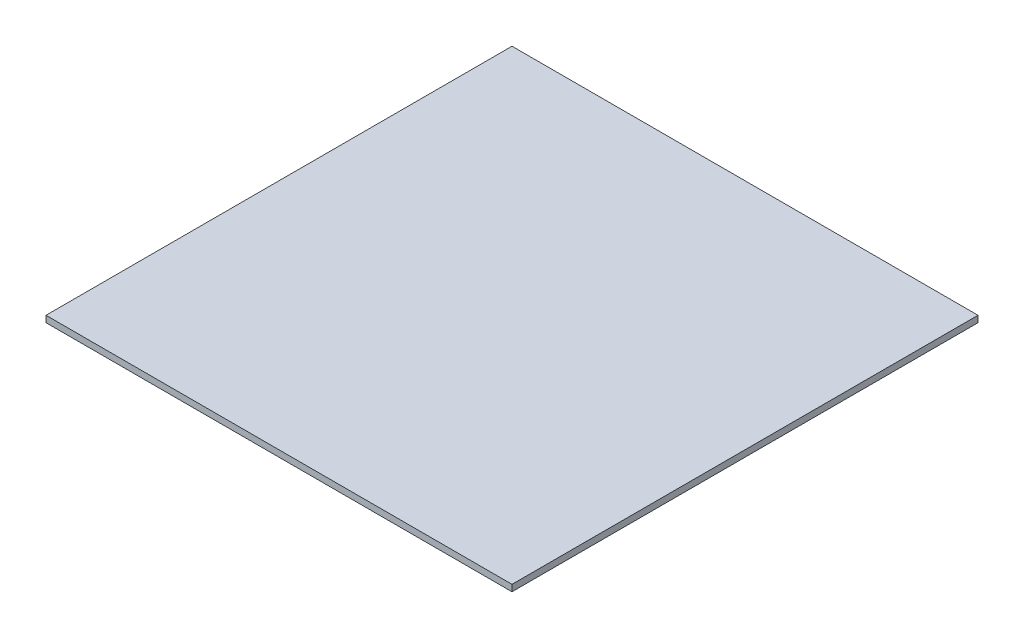
ISO-10303-21;
HEADER;
FILE_DESCRIPTION(('STEP AP214'),'2;1');
FILE_NAME('part.step','',(''),(''),'','','');
FILE_SCHEMA(('AUTOMOTIVE_DESIGN { 1 0 10303 214 1 1 1 1 }'));
ENDSEC;
DATA;
#1=APPLICATION_CONTEXT('core data for automotive mechanical design processes');
#2=APPLICATION_PROTOCOL_DEFINITION('international standard','automotive_design',2000,#1);
#3=PRODUCT_CONTEXT('',#1,'mechanical');
#4=PRODUCT('Part','Part','',(#3));
#5=PRODUCT_RELATED_PRODUCT_CATEGORY('part','',(#4));
#6=PRODUCT_DEFINITION_FORMATION('','',#4);
#7=PRODUCT_DEFINITION_CONTEXT('part definition',#1,'design');
#8=PRODUCT_DEFINITION('design','',#6,#7);
#9=PRODUCT_DEFINITION_SHAPE('','',#8);
#10=(LENGTH_UNIT() NAMED_UNIT(*) SI_UNIT(.MILLI.,.METRE.));
#11=(NAMED_UNIT(*) PLANE_ANGLE_UNIT() SI_UNIT($,.RADIAN.));
#12=(NAMED_UNIT(*) SI_UNIT($,.STERADIAN.) SOLID_ANGLE_UNIT());
#13=UNCERTAINTY_MEASURE_WITH_UNIT(LENGTH_MEASURE(1.E-05),#10,'distance_accuracy_value','');
#14=(GEOMETRIC_REPRESENTATION_CONTEXT(3) GLOBAL_UNCERTAINTY_ASSIGNED_CONTEXT((#13)) GLOBAL_UNIT_ASSIGNED_CONTEXT((#10,
#11,#12)) REPRESENTATION_CONTEXT('',''));
#15=CARTESIAN_POINT('',(0.,0.,0.));
#16=DIRECTION('',(0.,0.,1.));
#17=DIRECTION('',(1.,0.,0.));
#18=AXIS2_PLACEMENT_3D('',#15,#16,#17);
#19=CARTESIAN_POINT('',(228.6,6.35,-228.6));
#20=DIRECTION('',(-1.,0.,0.));
#21=DIRECTION('',(0.,0.,1.));
#22=AXIS2_PLACEMENT_3D('',#19,#20,#21);
#23=PLANE('',#22);
#24=DIRECTION('',(0.,0.,-1.));
#25=VECTOR('',#24,1.);
#26=CARTESIAN_POINT('',(228.6,0.,-228.6));
#27=LINE('',#26,#25);
#28=CARTESIAN_POINT('',(228.6,0.,228.6));
#29=VERTEX_POINT('',#28);
#30=CARTESIAN_POINT('',(228.6,0.,-228.6));
#31=VERTEX_POINT('',#30);
#32=EDGE_CURVE('E97',#29,#31,#27,.T.);
#33=ORIENTED_EDGE('',*,*,#32,.T.);
#34=DIRECTION('',(0.,-1.,0.));
#35=VECTOR('',#34,1.);
#36=CARTESIAN_POINT('',(228.6,6.35,-228.6));
#37=LINE('',#36,#35);
#38=CARTESIAN_POINT('',(228.6,6.35,-228.6));
#39=VERTEX_POINT('',#38);
#40=EDGE_CURVE('E11',#39,#31,#37,.T.);
#41=ORIENTED_EDGE('',*,*,#40,.F.);
#42=DIRECTION('',(0.,0.,-1.));
#43=VECTOR('',#42,1.);
#44=CARTESIAN_POINT('',(228.6,6.35,-228.6));
#45=LINE('',#44,#43);
#46=CARTESIAN_POINT('',(228.6,6.35,228.6));
#47=VERTEX_POINT('',#46);
#48=EDGE_CURVE('E85',#47,#39,#45,.T.);
#49=ORIENTED_EDGE('',*,*,#48,.F.);
#50=DIRECTION('',(0.,-1.,0.));
#51=VECTOR('',#50,1.);
#52=CARTESIAN_POINT('',(228.6,6.35,228.6));
#53=LINE('',#52,#51);
#54=EDGE_CURVE('E93',#47,#29,#53,.T.);
#55=ORIENTED_EDGE('',*,*,#54,.T.);
#56=EDGE_LOOP('',(#33,#41,#49,#55));
#57=FACE_BOUND('',#56,.T.);
#58=ADVANCED_FACE('F34',(#57),#23,.F.);
#59=CARTESIAN_POINT('',(-228.6,6.35,-228.6));
#60=DIRECTION('',(0.,0.,1.));
#61=DIRECTION('',(1.,0.,0.));
#62=AXIS2_PLACEMENT_3D('',#59,#60,#61);
#63=PLANE('',#62);
#64=DIRECTION('',(-1.,0.,0.));
#65=VECTOR('',#64,1.);
#66=CARTESIAN_POINT('',(-228.6,0.,-228.6));
#67=LINE('',#66,#65);
#68=CARTESIAN_POINT('',(-228.6,0.,-228.6));
#69=VERTEX_POINT('',#68);
#70=EDGE_CURVE('E89',#31,#69,#67,.T.);
#71=ORIENTED_EDGE('',*,*,#70,.T.);
#72=DIRECTION('',(0.,-1.,0.));
#73=VECTOR('',#72,1.);
#74=CARTESIAN_POINT('',(-228.6,6.35,-228.6));
#75=LINE('',#74,#73);
#76=CARTESIAN_POINT('',(-228.6,6.35,-228.6));
#77=VERTEX_POINT('',#76);
#78=EDGE_CURVE('E42',#77,#69,#75,.T.);
#79=ORIENTED_EDGE('',*,*,#78,.F.);
#80=DIRECTION('',(-1.,0.,0.));
#81=VECTOR('',#80,1.);
#82=CARTESIAN_POINT('',(-228.6,6.35,-228.6));
#83=LINE('',#82,#81);
#84=EDGE_CURVE('E80',#39,#77,#83,.T.);
#85=ORIENTED_EDGE('',*,*,#84,.F.);
#86=ORIENTED_EDGE('',*,*,#40,.T.);
#87=EDGE_LOOP('',(#71,#79,#85,#86));
#88=FACE_BOUND('',#87,.T.);
#89=ADVANCED_FACE('F88',(#88),#63,.F.);
#90=CARTESIAN_POINT('',(-228.6,6.35,-228.6));
#91=DIRECTION('',(1.,0.,0.));
#92=DIRECTION('',(0.,0.,-1.));
#93=AXIS2_PLACEMENT_3D('',#90,#91,#92);
#94=PLANE('',#93);
#95=DIRECTION('',(0.,0.,1.));
#96=VECTOR('',#95,1.);
#97=CARTESIAN_POINT('',(-228.6,0.,-228.6));
#98=LINE('',#97,#96);
#99=CARTESIAN_POINT('',(-228.6,0.,228.6));
#100=VERTEX_POINT('',#99);
#101=EDGE_CURVE('E67',#69,#100,#98,.T.);
#102=ORIENTED_EDGE('',*,*,#101,.T.);
#103=DIRECTION('',(0.,-1.,0.));
#104=VECTOR('',#103,1.);
#105=CARTESIAN_POINT('',(-228.6,6.35,228.6));
#106=LINE('',#105,#104);
#107=CARTESIAN_POINT('',(-228.6,6.35,228.6));
#108=VERTEX_POINT('',#107);
#109=EDGE_CURVE('E90',#108,#100,#106,.T.);
#110=ORIENTED_EDGE('',*,*,#109,.F.);
#111=DIRECTION('',(0.,0.,1.));
#112=VECTOR('',#111,1.);
#113=CARTESIAN_POINT('',(-228.6,6.35,-228.6));
#114=LINE('',#113,#112);
#115=EDGE_CURVE('E83',#77,#108,#114,.T.);
#116=ORIENTED_EDGE('',*,*,#115,.F.);
#117=ORIENTED_EDGE('',*,*,#78,.T.);
#118=EDGE_LOOP('',(#102,#110,#116,#117));
#119=FACE_BOUND('',#118,.T.);
#120=ADVANCED_FACE('F91',(#119),#94,.F.);
#121=CARTESIAN_POINT('',(-228.6,6.35,228.6));
#122=DIRECTION('',(0.,0.,-1.));
#123=DIRECTION('',(-1.,0.,0.));
#124=AXIS2_PLACEMENT_3D('',#121,#122,#123);
#125=PLANE('',#124);
#126=DIRECTION('',(1.,0.,0.));
#127=VECTOR('',#126,1.);
#128=CARTESIAN_POINT('',(-228.6,0.,228.6));
#129=LINE('',#128,#127);
#130=EDGE_CURVE('E73',#100,#29,#129,.T.);
#131=ORIENTED_EDGE('',*,*,#130,.T.);
#132=ORIENTED_EDGE('',*,*,#54,.F.);
#133=DIRECTION('',(1.,0.,0.));
#134=VECTOR('',#133,1.);
#135=CARTESIAN_POINT('',(-228.6,6.35,228.6));
#136=LINE('',#135,#134);
#137=EDGE_CURVE('E50',#108,#47,#136,.T.);
#138=ORIENTED_EDGE('',*,*,#137,.F.);
#139=ORIENTED_EDGE('',*,*,#109,.T.);
#140=EDGE_LOOP('',(#131,#132,#138,#139));
#141=FACE_BOUND('',#140,.T.);
#142=ADVANCED_FACE('F104',(#141),#125,.F.);
#143=CARTESIAN_POINT('',(0.,6.35,0.));
#144=DIRECTION('',(0.,1.,0.));
#145=DIRECTION('',(0.,0.,1.));
#146=AXIS2_PLACEMENT_3D('',#143,#144,#145);
#147=PLANE('',#146);
#148=ORIENTED_EDGE('',*,*,#48,.T.);
#149=ORIENTED_EDGE('',*,*,#84,.T.);
#150=ORIENTED_EDGE('',*,*,#115,.T.);
#151=ORIENTED_EDGE('',*,*,#137,.T.);
#152=EDGE_LOOP('',(#148,#149,#150,#151));
#153=FACE_BOUND('',#152,.T.);
#154=ADVANCED_FACE('F81',(#153),#147,.T.);
#155=CARTESIAN_POINT('',(0.,0.,0.));
#156=DIRECTION('',(0.,1.,0.));
#157=DIRECTION('',(0.,0.,1.));
#158=AXIS2_PLACEMENT_3D('',#155,#156,#157);
#159=PLANE('',#158);
#160=ORIENTED_EDGE('',*,*,#32,.F.);
#161=ORIENTED_EDGE('',*,*,#130,.F.);
#162=ORIENTED_EDGE('',*,*,#101,.F.);
#163=ORIENTED_EDGE('',*,*,#70,.F.);
#164=EDGE_LOOP('',(#160,#161,#162,#163));
#165=FACE_BOUND('',#164,.T.);
#166=ADVANCED_FACE('F107',(#165),#159,.F.);
#167=CLOSED_SHELL('',(#58,#89,#120,#142,#154,#166));
#168=MANIFOLD_SOLID_BREP('B2',#167);
#169=ADVANCED_BREP_SHAPE_REPRESENTATION('',(#18,#168),#14);
#170=SHAPE_DEFINITION_REPRESENTATION(#9,#169);
ENDSEC;
END-ISO-10303-21;
